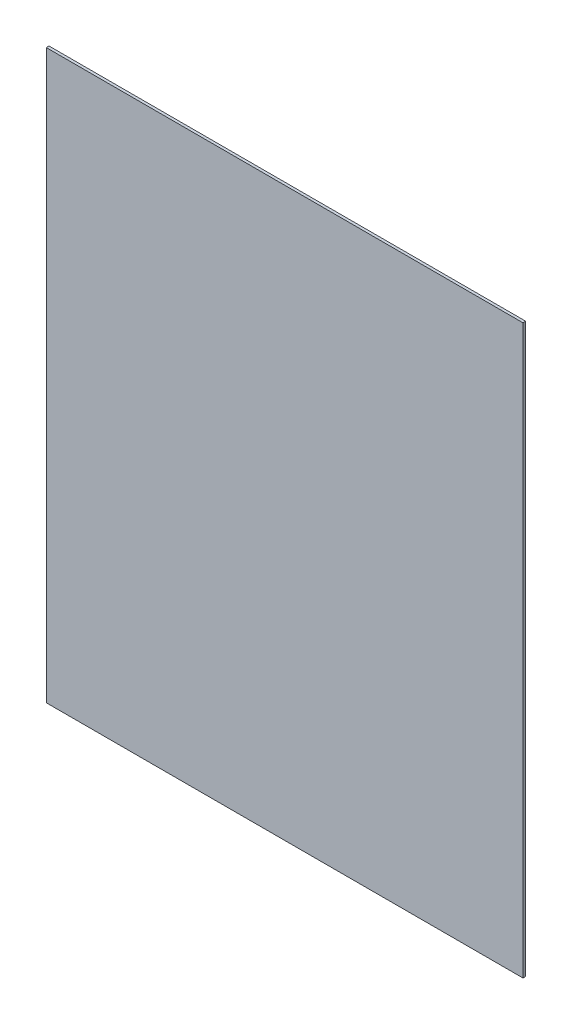
ISO-10303-21;
HEADER;
FILE_DESCRIPTION(('STEP AP214'),'2;1');
FILE_NAME('part.step','',(''),(''),'','','');
FILE_SCHEMA(('AUTOMOTIVE_DESIGN { 1 0 10303 214 1 1 1 1 }'));
ENDSEC;
DATA;
#1=APPLICATION_CONTEXT('core data for automotive mechanical design processes');
#2=APPLICATION_PROTOCOL_DEFINITION('international standard','automotive_design',2000,#1);
#3=PRODUCT_CONTEXT('',#1,'mechanical');
#4=PRODUCT('Part','Part','',(#3));
#5=PRODUCT_RELATED_PRODUCT_CATEGORY('part','',(#4));
#6=PRODUCT_DEFINITION_FORMATION('','',#4);
#7=PRODUCT_DEFINITION_CONTEXT('part definition',#1,'design');
#8=PRODUCT_DEFINITION('design','',#6,#7);
#9=PRODUCT_DEFINITION_SHAPE('','',#8);
#10=(LENGTH_UNIT() NAMED_UNIT(*) SI_UNIT(.MILLI.,.METRE.));
#11=(NAMED_UNIT(*) PLANE_ANGLE_UNIT() SI_UNIT($,.RADIAN.));
#12=(NAMED_UNIT(*) SI_UNIT($,.STERADIAN.) SOLID_ANGLE_UNIT());
#13=UNCERTAINTY_MEASURE_WITH_UNIT(LENGTH_MEASURE(1.E-05),#10,'distance_accuracy_value','');
#14=(GEOMETRIC_REPRESENTATION_CONTEXT(3) GLOBAL_UNCERTAINTY_ASSIGNED_CONTEXT((#13)) GLOBAL_UNIT_ASSIGNED_CONTEXT((#10,
#11,#12)) REPRESENTATION_CONTEXT('',''));
#15=CARTESIAN_POINT('',(0.,0.,0.));
#16=DIRECTION('',(0.,0.,1.));
#17=DIRECTION('',(1.,0.,0.));
#18=AXIS2_PLACEMENT_3D('',#15,#16,#17);
#19=CARTESIAN_POINT('',(0.,0.,-12.));
#20=DIRECTION('',(-1.,0.,0.));
#21=DIRECTION('',(0.,-1.,0.));
#22=AXIS2_PLACEMENT_3D('',#19,#20,#21);
#23=PLANE('',#22);
#24=DIRECTION('',(0.,-1.,0.));
#25=VECTOR('',#24,1.);
#26=CARTESIAN_POINT('',(0.,0.,0.));
#27=LINE('',#26,#25);
#28=CARTESIAN_POINT('',(-3.06161699786838E-13,2500.,0.));
#29=VERTEX_POINT('',#28);
#30=CARTESIAN_POINT('',(0.,0.,0.));
#31=VERTEX_POINT('',#30);
#32=EDGE_CURVE('E102',#29,#31,#27,.T.);
#33=ORIENTED_EDGE('',*,*,#32,.F.);
#34=DIRECTION('',(0.,0.,1.));
#35=VECTOR('',#34,1.);
#36=CARTESIAN_POINT('',(-3.06161699786838E-13,2500.,-12.));
#37=LINE('',#36,#35);
#38=CARTESIAN_POINT('',(-3.06161699786838E-13,2500.,-12.));
#39=VERTEX_POINT('',#38);
#40=EDGE_CURVE('E11',#39,#29,#37,.T.);
#41=ORIENTED_EDGE('',*,*,#40,.F.);
#42=DIRECTION('',(0.,-1.,0.));
#43=VECTOR('',#42,1.);
#44=CARTESIAN_POINT('',(0.,0.,-12.));
#45=LINE('',#44,#43);
#46=CARTESIAN_POINT('',(0.,0.,-12.));
#47=VERTEX_POINT('',#46);
#48=EDGE_CURVE('E96',#39,#47,#45,.T.);
#49=ORIENTED_EDGE('',*,*,#48,.T.);
#50=DIRECTION('',(0.,0.,1.));
#51=VECTOR('',#50,1.);
#52=CARTESIAN_POINT('',(0.,0.,-12.));
#53=LINE('',#52,#51);
#54=EDGE_CURVE('E41',#47,#31,#53,.T.);
#55=ORIENTED_EDGE('',*,*,#54,.T.);
#56=EDGE_LOOP('',(#33,#41,#49,#55));
#57=FACE_BOUND('',#56,.T.);
#58=ADVANCED_FACE('F38',(#57),#23,.T.);
#59=CARTESIAN_POINT('',(-3.06161699786838E-13,2500.,-12.));
#60=DIRECTION('',(0.,1.,0.));
#61=DIRECTION('',(0.,0.,1.));
#62=AXIS2_PLACEMENT_3D('',#59,#60,#61);
#63=PLANE('',#62);
#64=DIRECTION('',(-1.,0.,0.));
#65=VECTOR('',#64,1.);
#66=CARTESIAN_POINT('',(-3.06161699786838E-13,2500.,0.));
#67=LINE('',#66,#65);
#68=CARTESIAN_POINT('',(2100.,2500.,0.));
#69=VERTEX_POINT('',#68);
#70=EDGE_CURVE('E98',#69,#29,#67,.T.);
#71=ORIENTED_EDGE('',*,*,#70,.F.);
#72=DIRECTION('',(0.,0.,1.));
#73=VECTOR('',#72,1.);
#74=CARTESIAN_POINT('',(2100.,2500.,-12.));
#75=LINE('',#74,#73);
#76=CARTESIAN_POINT('',(2100.,2500.,-12.));
#77=VERTEX_POINT('',#76);
#78=EDGE_CURVE('E47',#77,#69,#75,.T.);
#79=ORIENTED_EDGE('',*,*,#78,.F.);
#80=DIRECTION('',(-1.,0.,0.));
#81=VECTOR('',#80,1.);
#82=CARTESIAN_POINT('',(-3.06161699786838E-13,2500.,-12.));
#83=LINE('',#82,#81);
#84=EDGE_CURVE('E93',#77,#39,#83,.T.);
#85=ORIENTED_EDGE('',*,*,#84,.T.);
#86=ORIENTED_EDGE('',*,*,#40,.T.);
#87=EDGE_LOOP('',(#71,#79,#85,#86));
#88=FACE_BOUND('',#87,.T.);
#89=ADVANCED_FACE('F112',(#88),#63,.T.);
#90=CARTESIAN_POINT('',(2100.,0.,-12.));
#91=DIRECTION('',(1.,0.,0.));
#92=DIRECTION('',(0.,0.,-1.));
#93=AXIS2_PLACEMENT_3D('',#90,#91,#92);
#94=PLANE('',#93);
#95=DIRECTION('',(0.,1.,0.));
#96=VECTOR('',#95,1.);
#97=CARTESIAN_POINT('',(2100.,0.,0.));
#98=LINE('',#97,#96);
#99=CARTESIAN_POINT('',(2100.,0.,0.));
#100=VERTEX_POINT('',#99);
#101=EDGE_CURVE('E88',#100,#69,#98,.T.);
#102=ORIENTED_EDGE('',*,*,#101,.F.);
#103=DIRECTION('',(0.,0.,1.));
#104=VECTOR('',#103,1.);
#105=CARTESIAN_POINT('',(2100.,0.,-12.));
#106=LINE('',#105,#104);
#107=CARTESIAN_POINT('',(2100.,0.,-12.));
#108=VERTEX_POINT('',#107);
#109=EDGE_CURVE('E83',#108,#100,#106,.T.);
#110=ORIENTED_EDGE('',*,*,#109,.F.);
#111=DIRECTION('',(0.,1.,0.));
#112=VECTOR('',#111,1.);
#113=CARTESIAN_POINT('',(2100.,0.,-12.));
#114=LINE('',#113,#112);
#115=EDGE_CURVE('E86',#108,#77,#114,.T.);
#116=ORIENTED_EDGE('',*,*,#115,.T.);
#117=ORIENTED_EDGE('',*,*,#78,.T.);
#118=EDGE_LOOP('',(#102,#110,#116,#117));
#119=FACE_BOUND('',#118,.T.);
#120=ADVANCED_FACE('F85',(#119),#94,.T.);
#121=CARTESIAN_POINT('',(0.,0.,-12.));
#122=DIRECTION('',(0.,-1.,0.));
#123=DIRECTION('',(0.,0.,-1.));
#124=AXIS2_PLACEMENT_3D('',#121,#122,#123);
#125=PLANE('',#124);
#126=DIRECTION('',(1.,0.,0.));
#127=VECTOR('',#126,1.);
#128=CARTESIAN_POINT('',(0.,0.,0.));
#129=LINE('',#128,#127);
#130=EDGE_CURVE('E105',#31,#100,#129,.T.);
#131=ORIENTED_EDGE('',*,*,#130,.F.);
#132=ORIENTED_EDGE('',*,*,#54,.F.);
#133=DIRECTION('',(1.,0.,0.));
#134=VECTOR('',#133,1.);
#135=CARTESIAN_POINT('',(0.,0.,-12.));
#136=LINE('',#135,#134);
#137=EDGE_CURVE('E92',#47,#108,#136,.T.);
#138=ORIENTED_EDGE('',*,*,#137,.T.);
#139=ORIENTED_EDGE('',*,*,#109,.T.);
#140=EDGE_LOOP('',(#131,#132,#138,#139));
#141=FACE_BOUND('',#140,.T.);
#142=ADVANCED_FACE('F95',(#141),#125,.T.);
#143=CARTESIAN_POINT('',(0.,0.,-12.));
#144=DIRECTION('',(0.,0.,-1.));
#145=DIRECTION('',(-1.,0.,0.));
#146=AXIS2_PLACEMENT_3D('',#143,#144,#145);
#147=PLANE('',#146);
#148=ORIENTED_EDGE('',*,*,#48,.F.);
#149=ORIENTED_EDGE('',*,*,#84,.F.);
#150=ORIENTED_EDGE('',*,*,#115,.F.);
#151=ORIENTED_EDGE('',*,*,#137,.F.);
#152=EDGE_LOOP('',(#148,#149,#150,#151));
#153=FACE_BOUND('',#152,.T.);
#154=ADVANCED_FACE('F91',(#153),#147,.T.);
#155=CARTESIAN_POINT('',(0.,0.,0.));
#156=DIRECTION('',(0.,0.,-1.));
#157=DIRECTION('',(-1.,0.,0.));
#158=AXIS2_PLACEMENT_3D('',#155,#156,#157);
#159=PLANE('',#158);
#160=ORIENTED_EDGE('',*,*,#32,.T.);
#161=ORIENTED_EDGE('',*,*,#130,.T.);
#162=ORIENTED_EDGE('',*,*,#101,.T.);
#163=ORIENTED_EDGE('',*,*,#70,.T.);
#164=EDGE_LOOP('',(#160,#161,#162,#163));
#165=FACE_BOUND('',#164,.T.);
#166=ADVANCED_FACE('F111',(#165),#159,.F.);
#167=CLOSED_SHELL('',(#58,#89,#120,#142,#154,#166));
#168=MANIFOLD_SOLID_BREP('B2',#167);
#169=ADVANCED_BREP_SHAPE_REPRESENTATION('',(#18,#168),#14);
#170=SHAPE_DEFINITION_REPRESENTATION(#9,#169);
ENDSEC;
END-ISO-10303-21;
